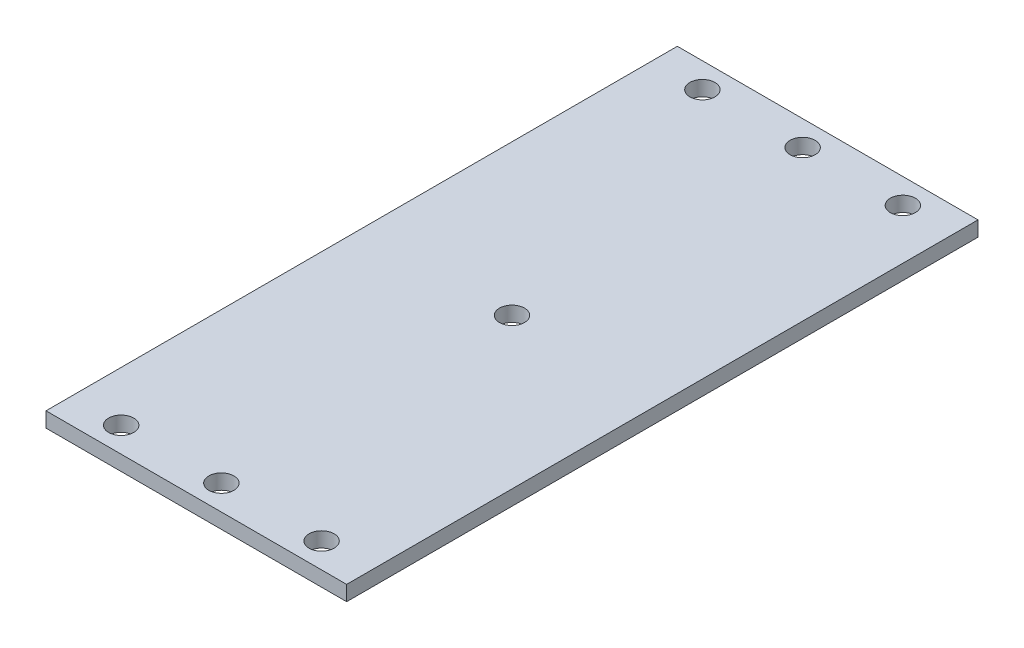
ISO-10303-21;
HEADER;
FILE_DESCRIPTION(('STEP AP214'),'2;1');
FILE_NAME('part.step','',(''),(''),'','','');
FILE_SCHEMA(('AUTOMOTIVE_DESIGN { 1 0 10303 214 1 1 1 1 }'));
ENDSEC;
DATA;
#1=APPLICATION_CONTEXT('core data for automotive mechanical design processes');
#2=APPLICATION_PROTOCOL_DEFINITION('international standard','automotive_design',2000,#1);
#3=PRODUCT_CONTEXT('',#1,'mechanical');
#4=PRODUCT('Part','Part','',(#3));
#5=PRODUCT_RELATED_PRODUCT_CATEGORY('part','',(#4));
#6=PRODUCT_DEFINITION_FORMATION('','',#4);
#7=PRODUCT_DEFINITION_CONTEXT('part definition',#1,'design');
#8=PRODUCT_DEFINITION('design','',#6,#7);
#9=PRODUCT_DEFINITION_SHAPE('','',#8);
#10=(LENGTH_UNIT() NAMED_UNIT(*) SI_UNIT(.MILLI.,.METRE.));
#11=(NAMED_UNIT(*) PLANE_ANGLE_UNIT() SI_UNIT($,.RADIAN.));
#12=(NAMED_UNIT(*) SI_UNIT($,.STERADIAN.) SOLID_ANGLE_UNIT());
#13=UNCERTAINTY_MEASURE_WITH_UNIT(LENGTH_MEASURE(1.E-05),#10,'distance_accuracy_value','');
#14=(GEOMETRIC_REPRESENTATION_CONTEXT(3) GLOBAL_UNCERTAINTY_ASSIGNED_CONTEXT((#13)) GLOBAL_UNIT_ASSIGNED_CONTEXT((#10,
#11,#12)) REPRESENTATION_CONTEXT('',''));
#15=CARTESIAN_POINT('',(0.,0.,0.));
#16=DIRECTION('',(0.,0.,1.));
#17=DIRECTION('',(1.,0.,0.));
#18=AXIS2_PLACEMENT_3D('',#15,#16,#17);
#19=CARTESIAN_POINT('',(30.,3.,-63.));
#20=DIRECTION('',(-1.,0.,0.));
#21=DIRECTION('',(0.,0.,1.));
#22=AXIS2_PLACEMENT_3D('',#19,#20,#21);
#23=PLANE('',#22);
#24=DIRECTION('',(0.,0.,-1.));
#25=VECTOR('',#24,1.);
#26=CARTESIAN_POINT('',(30.,0.,-63.));
#27=LINE('',#26,#25);
#28=CARTESIAN_POINT('',(30.,0.,63.));
#29=VERTEX_POINT('',#28);
#30=CARTESIAN_POINT('',(30.,0.,-63.));
#31=VERTEX_POINT('',#30);
#32=EDGE_CURVE('E110',#29,#31,#27,.T.);
#33=ORIENTED_EDGE('',*,*,#32,.T.);
#34=DIRECTION('',(0.,-1.,0.));
#35=VECTOR('',#34,1.);
#36=CARTESIAN_POINT('',(30.,3.,-63.));
#37=LINE('',#36,#35);
#38=CARTESIAN_POINT('',(30.,3.,-63.));
#39=VERTEX_POINT('',#38);
#40=EDGE_CURVE('E11',#39,#31,#37,.T.);
#41=ORIENTED_EDGE('',*,*,#40,.F.);
#42=DIRECTION('',(0.,0.,-1.));
#43=VECTOR('',#42,1.);
#44=CARTESIAN_POINT('',(30.,3.,-63.));
#45=LINE('',#44,#43);
#46=CARTESIAN_POINT('',(30.,3.,63.));
#47=VERTEX_POINT('',#46);
#48=EDGE_CURVE('E93',#47,#39,#45,.T.);
#49=ORIENTED_EDGE('',*,*,#48,.F.);
#50=DIRECTION('',(0.,-1.,0.));
#51=VECTOR('',#50,1.);
#52=CARTESIAN_POINT('',(30.,3.,63.));
#53=LINE('',#52,#51);
#54=EDGE_CURVE('E106',#47,#29,#53,.T.);
#55=ORIENTED_EDGE('',*,*,#54,.T.);
#56=EDGE_LOOP('',(#33,#41,#49,#55));
#57=FACE_BOUND('',#56,.T.);
#58=ADVANCED_FACE('F39',(#57),#23,.F.);
#59=CARTESIAN_POINT('',(-30.,3.,-63.));
#60=DIRECTION('',(0.,0.,1.));
#61=DIRECTION('',(1.,0.,0.));
#62=AXIS2_PLACEMENT_3D('',#59,#60,#61);
#63=PLANE('',#62);
#64=DIRECTION('',(-1.,0.,0.));
#65=VECTOR('',#64,1.);
#66=CARTESIAN_POINT('',(-30.,0.,-63.));
#67=LINE('',#66,#65);
#68=CARTESIAN_POINT('',(-30.,0.,-63.));
#69=VERTEX_POINT('',#68);
#70=EDGE_CURVE('E98',#31,#69,#67,.T.);
#71=ORIENTED_EDGE('',*,*,#70,.T.);
#72=DIRECTION('',(0.,-1.,0.));
#73=VECTOR('',#72,1.);
#74=CARTESIAN_POINT('',(-30.,3.,-63.));
#75=LINE('',#74,#73);
#76=CARTESIAN_POINT('',(-30.,3.,-63.));
#77=VERTEX_POINT('',#76);
#78=EDGE_CURVE('E49',#77,#69,#75,.T.);
#79=ORIENTED_EDGE('',*,*,#78,.F.);
#80=DIRECTION('',(-1.,0.,0.));
#81=VECTOR('',#80,1.);
#82=CARTESIAN_POINT('',(-30.,3.,-63.));
#83=LINE('',#82,#81);
#84=EDGE_CURVE('E88',#39,#77,#83,.T.);
#85=ORIENTED_EDGE('',*,*,#84,.F.);
#86=ORIENTED_EDGE('',*,*,#40,.T.);
#87=EDGE_LOOP('',(#71,#79,#85,#86));
#88=FACE_BOUND('',#87,.T.);
#89=ADVANCED_FACE('F97',(#88),#63,.F.);
#90=CARTESIAN_POINT('',(-30.,3.,-63.));
#91=DIRECTION('',(1.,0.,0.));
#92=DIRECTION('',(0.,0.,-1.));
#93=AXIS2_PLACEMENT_3D('',#90,#91,#92);
#94=PLANE('',#93);
#95=DIRECTION('',(0.,0.,1.));
#96=VECTOR('',#95,1.);
#97=CARTESIAN_POINT('',(-30.,0.,-63.));
#98=LINE('',#97,#96);
#99=CARTESIAN_POINT('',(-30.,0.,63.));
#100=VERTEX_POINT('',#99);
#101=EDGE_CURVE('E75',#69,#100,#98,.T.);
#102=ORIENTED_EDGE('',*,*,#101,.T.);
#103=DIRECTION('',(0.,-1.,0.));
#104=VECTOR('',#103,1.);
#105=CARTESIAN_POINT('',(-30.,3.,63.));
#106=LINE('',#105,#104);
#107=CARTESIAN_POINT('',(-30.,3.,63.));
#108=VERTEX_POINT('',#107);
#109=EDGE_CURVE('E100',#108,#100,#106,.T.);
#110=ORIENTED_EDGE('',*,*,#109,.F.);
#111=DIRECTION('',(0.,0.,1.));
#112=VECTOR('',#111,1.);
#113=CARTESIAN_POINT('',(-30.,3.,-63.));
#114=LINE('',#113,#112);
#115=EDGE_CURVE('E91',#77,#108,#114,.T.);
#116=ORIENTED_EDGE('',*,*,#115,.F.);
#117=ORIENTED_EDGE('',*,*,#78,.T.);
#118=EDGE_LOOP('',(#102,#110,#116,#117));
#119=FACE_BOUND('',#118,.T.);
#120=ADVANCED_FACE('F102',(#119),#94,.F.);
#121=CARTESIAN_POINT('',(-30.,3.,63.));
#122=DIRECTION('',(0.,0.,-1.));
#123=DIRECTION('',(-1.,0.,0.));
#124=AXIS2_PLACEMENT_3D('',#121,#122,#123);
#125=PLANE('',#124);
#126=DIRECTION('',(1.,0.,0.));
#127=VECTOR('',#126,1.);
#128=CARTESIAN_POINT('',(-30.,0.,63.));
#129=LINE('',#128,#127);
#130=EDGE_CURVE('E81',#100,#29,#129,.T.);
#131=ORIENTED_EDGE('',*,*,#130,.T.);
#132=ORIENTED_EDGE('',*,*,#54,.F.);
#133=DIRECTION('',(1.,0.,0.));
#134=VECTOR('',#133,1.);
#135=CARTESIAN_POINT('',(-30.,3.,63.));
#136=LINE('',#135,#134);
#137=EDGE_CURVE('E58',#108,#47,#136,.T.);
#138=ORIENTED_EDGE('',*,*,#137,.F.);
#139=ORIENTED_EDGE('',*,*,#109,.T.);
#140=EDGE_LOOP('',(#131,#132,#138,#139));
#141=FACE_BOUND('',#140,.T.);
#142=ADVANCED_FACE('F185',(#141),#125,.F.);
#143=CARTESIAN_POINT('',(0.,3.,0.));
#144=DIRECTION('',(0.,1.,0.));
#145=DIRECTION('',(0.,0.,1.));
#146=AXIS2_PLACEMENT_3D('',#143,#144,#145);
#147=PLANE('',#146);
#148=CARTESIAN_POINT('',(20.,3.,58.));
#149=DIRECTION('',(0.,1.,0.));
#150=DIRECTION('',(0.,0.,1.));
#151=AXIS2_PLACEMENT_3D('',#148,#149,#150);
#152=CIRCLE('',#151,2.5);
#153=CARTESIAN_POINT('',(20.,3.,60.5));
#154=VERTEX_POINT('',#153);
#155=EDGE_CURVE('E291',#154,#154,#152,.T.);
#156=ORIENTED_EDGE('',*,*,#155,.F.);
#157=EDGE_LOOP('',(#156));
#158=FACE_BOUND('',#157,.T.);
#159=CARTESIAN_POINT('',(-20.,3.,58.));
#160=DIRECTION('',(0.,1.,0.));
#161=DIRECTION('',(0.,0.,1.));
#162=AXIS2_PLACEMENT_3D('',#159,#160,#161);
#163=CIRCLE('',#162,2.5);
#164=CARTESIAN_POINT('',(-20.,3.,60.5));
#165=VERTEX_POINT('',#164);
#166=EDGE_CURVE('E285',#165,#165,#163,.T.);
#167=ORIENTED_EDGE('',*,*,#166,.F.);
#168=EDGE_LOOP('',(#167));
#169=FACE_BOUND('',#168,.T.);
#170=CARTESIAN_POINT('',(20.,3.,-58.));
#171=DIRECTION('',(0.,1.,0.));
#172=DIRECTION('',(0.,0.,-1.));
#173=AXIS2_PLACEMENT_3D('',#170,#171,#172);
#174=CIRCLE('',#173,2.5);
#175=CARTESIAN_POINT('',(20.,3.,-60.5));
#176=VERTEX_POINT('',#175);
#177=EDGE_CURVE('E268',#176,#176,#174,.T.);
#178=ORIENTED_EDGE('',*,*,#177,.F.);
#179=EDGE_LOOP('',(#178));
#180=FACE_BOUND('',#179,.T.);
#181=CARTESIAN_POINT('',(0.,3.,-58.));
#182=DIRECTION('',(0.,1.,0.));
#183=DIRECTION('',(0.,0.,-1.));
#184=AXIS2_PLACEMENT_3D('',#181,#182,#183);
#185=CIRCLE('',#184,2.5);
#186=CARTESIAN_POINT('',(0.,3.,-60.5));
#187=VERTEX_POINT('',#186);
#188=EDGE_CURVE('E286',#187,#187,#185,.T.);
#189=ORIENTED_EDGE('',*,*,#188,.F.);
#190=EDGE_LOOP('',(#189));
#191=FACE_BOUND('',#190,.T.);
#192=CARTESIAN_POINT('',(-20.,3.,-58.));
#193=DIRECTION('',(0.,1.,0.));
#194=DIRECTION('',(0.,0.,-1.));
#195=AXIS2_PLACEMENT_3D('',#192,#193,#194);
#196=CIRCLE('',#195,2.5);
#197=CARTESIAN_POINT('',(-20.,3.,-60.5));
#198=VERTEX_POINT('',#197);
#199=EDGE_CURVE('E294',#198,#198,#196,.T.);
#200=ORIENTED_EDGE('',*,*,#199,.F.);
#201=EDGE_LOOP('',(#200));
#202=FACE_BOUND('',#201,.T.);
#203=CARTESIAN_POINT('',(0.,3.,0.));
#204=DIRECTION('',(0.,1.,0.));
#205=DIRECTION('',(0.,0.,1.));
#206=AXIS2_PLACEMENT_3D('',#203,#204,#205);
#207=CIRCLE('',#206,2.5);
#208=CARTESIAN_POINT('',(0.,3.,2.49999999999999));
#209=VERTEX_POINT('',#208);
#210=EDGE_CURVE('E305',#209,#209,#207,.T.);
#211=ORIENTED_EDGE('',*,*,#210,.F.);
#212=EDGE_LOOP('',(#211));
#213=FACE_BOUND('',#212,.T.);
#214=CARTESIAN_POINT('',(0.,3.,58.));
#215=DIRECTION('',(0.,1.,0.));
#216=DIRECTION('',(0.,0.,1.));
#217=AXIS2_PLACEMENT_3D('',#214,#215,#216);
#218=CIRCLE('',#217,2.5);
#219=CARTESIAN_POINT('',(0.,3.,60.5));
#220=VERTEX_POINT('',#219);
#221=EDGE_CURVE('E129',#220,#220,#218,.T.);
#222=ORIENTED_EDGE('',*,*,#221,.F.);
#223=EDGE_LOOP('',(#222));
#224=FACE_BOUND('',#223,.T.);
#225=ORIENTED_EDGE('',*,*,#48,.T.);
#226=ORIENTED_EDGE('',*,*,#84,.T.);
#227=ORIENTED_EDGE('',*,*,#115,.T.);
#228=ORIENTED_EDGE('',*,*,#137,.T.);
#229=EDGE_LOOP('',(#225,#226,#227,#228));
#230=FACE_BOUND('',#229,.T.);
#231=ADVANCED_FACE('F89',(#158,#169,#180,#191,#202,#213,#224,#230),#147,.T.);
#232=CARTESIAN_POINT('',(0.,0.,0.));
#233=DIRECTION('',(0.,1.,0.));
#234=DIRECTION('',(0.,0.,1.));
#235=AXIS2_PLACEMENT_3D('',#232,#233,#234);
#236=PLANE('',#235);
#237=CARTESIAN_POINT('',(20.,0.,58.));
#238=DIRECTION('',(0.,1.,0.));
#239=DIRECTION('',(0.,0.,1.));
#240=AXIS2_PLACEMENT_3D('',#237,#238,#239);
#241=CIRCLE('',#240,2.5);
#242=CARTESIAN_POINT('',(20.,0.,60.5));
#243=VERTEX_POINT('',#242);
#244=EDGE_CURVE('E42',#243,#243,#241,.T.);
#245=ORIENTED_EDGE('',*,*,#244,.T.);
#246=EDGE_LOOP('',(#245));
#247=FACE_BOUND('',#246,.T.);
#248=CARTESIAN_POINT('',(-20.,0.,58.));
#249=DIRECTION('',(0.,1.,0.));
#250=DIRECTION('',(0.,0.,1.));
#251=AXIS2_PLACEMENT_3D('',#248,#249,#250);
#252=CIRCLE('',#251,2.5);
#253=CARTESIAN_POINT('',(-20.,0.,60.5));
#254=VERTEX_POINT('',#253);
#255=EDGE_CURVE('E144',#254,#254,#252,.T.);
#256=ORIENTED_EDGE('',*,*,#255,.T.);
#257=EDGE_LOOP('',(#256));
#258=FACE_BOUND('',#257,.T.);
#259=CARTESIAN_POINT('',(20.,0.,-58.));
#260=DIRECTION('',(0.,1.,0.));
#261=DIRECTION('',(0.,0.,1.));
#262=AXIS2_PLACEMENT_3D('',#259,#260,#261);
#263=CIRCLE('',#262,2.5);
#264=CARTESIAN_POINT('',(20.,0.,-55.5));
#265=VERTEX_POINT('',#264);
#266=EDGE_CURVE('E141',#265,#265,#263,.T.);
#267=ORIENTED_EDGE('',*,*,#266,.T.);
#268=EDGE_LOOP('',(#267));
#269=FACE_BOUND('',#268,.T.);
#270=CARTESIAN_POINT('',(0.,0.,-58.));
#271=DIRECTION('',(0.,1.,0.));
#272=DIRECTION('',(0.,0.,1.));
#273=AXIS2_PLACEMENT_3D('',#270,#271,#272);
#274=CIRCLE('',#273,2.5);
#275=CARTESIAN_POINT('',(0.,0.,-55.5));
#276=VERTEX_POINT('',#275);
#277=EDGE_CURVE('E137',#276,#276,#274,.T.);
#278=ORIENTED_EDGE('',*,*,#277,.T.);
#279=EDGE_LOOP('',(#278));
#280=FACE_BOUND('',#279,.T.);
#281=CARTESIAN_POINT('',(-20.,0.,-58.));
#282=DIRECTION('',(0.,1.,0.));
#283=DIRECTION('',(0.,0.,1.));
#284=AXIS2_PLACEMENT_3D('',#281,#282,#283);
#285=CIRCLE('',#284,2.5);
#286=CARTESIAN_POINT('',(-20.,0.,-55.5));
#287=VERTEX_POINT('',#286);
#288=EDGE_CURVE('E133',#287,#287,#285,.T.);
#289=ORIENTED_EDGE('',*,*,#288,.T.);
#290=EDGE_LOOP('',(#289));
#291=FACE_BOUND('',#290,.T.);
#292=CARTESIAN_POINT('',(0.,0.,0.));
#293=DIRECTION('',(0.,1.,0.));
#294=DIRECTION('',(0.,0.,1.));
#295=AXIS2_PLACEMENT_3D('',#292,#293,#294);
#296=CIRCLE('',#295,2.5);
#297=CARTESIAN_POINT('',(0.,0.,2.49999999999999));
#298=VERTEX_POINT('',#297);
#299=EDGE_CURVE('E128',#298,#298,#296,.T.);
#300=ORIENTED_EDGE('',*,*,#299,.T.);
#301=EDGE_LOOP('',(#300));
#302=FACE_BOUND('',#301,.T.);
#303=CARTESIAN_POINT('',(0.,0.,58.));
#304=DIRECTION('',(0.,1.,0.));
#305=DIRECTION('',(0.,0.,1.));
#306=AXIS2_PLACEMENT_3D('',#303,#304,#305);
#307=CIRCLE('',#306,2.5);
#308=CARTESIAN_POINT('',(0.,0.,60.5));
#309=VERTEX_POINT('',#308);
#310=EDGE_CURVE('E124',#309,#309,#307,.T.);
#311=ORIENTED_EDGE('',*,*,#310,.T.);
#312=EDGE_LOOP('',(#311));
#313=FACE_BOUND('',#312,.T.);
#314=ORIENTED_EDGE('',*,*,#32,.F.);
#315=ORIENTED_EDGE('',*,*,#130,.F.);
#316=ORIENTED_EDGE('',*,*,#101,.F.);
#317=ORIENTED_EDGE('',*,*,#70,.F.);
#318=EDGE_LOOP('',(#314,#315,#316,#317));
#319=FACE_BOUND('',#318,.T.);
#320=ADVANCED_FACE('F153',(#247,#258,#269,#280,#291,#302,#313,#319),#236,.F.);
#321=CARTESIAN_POINT('',(0.,-2.,58.));
#322=DIRECTION('',(0.,1.,0.));
#323=DIRECTION('',(0.,0.,1.));
#324=AXIS2_PLACEMENT_3D('',#321,#322,#323);
#325=CYLINDRICAL_SURFACE('',#324,2.5);
#326=ORIENTED_EDGE('',*,*,#221,.T.);
#327=EDGE_LOOP('',(#326));
#328=FACE_BOUND('',#327,.T.);
#329=ORIENTED_EDGE('',*,*,#310,.F.);
#330=EDGE_LOOP('',(#329));
#331=FACE_BOUND('',#330,.T.);
#332=ADVANCED_FACE('F176',(#328,#331),#325,.F.);
#333=CARTESIAN_POINT('',(0.,-2.,0.));
#334=DIRECTION('',(0.,1.,0.));
#335=DIRECTION('',(0.,0.,1.));
#336=AXIS2_PLACEMENT_3D('',#333,#334,#335);
#337=CYLINDRICAL_SURFACE('',#336,2.5);
#338=ORIENTED_EDGE('',*,*,#210,.T.);
#339=EDGE_LOOP('',(#338));
#340=FACE_BOUND('',#339,.T.);
#341=ORIENTED_EDGE('',*,*,#299,.F.);
#342=EDGE_LOOP('',(#341));
#343=FACE_BOUND('',#342,.T.);
#344=ADVANCED_FACE('F182',(#340,#343),#337,.F.);
#345=CARTESIAN_POINT('',(-20.,-2.,-58.));
#346=DIRECTION('',(0.,1.,0.));
#347=DIRECTION('',(0.,0.,1.));
#348=AXIS2_PLACEMENT_3D('',#345,#346,#347);
#349=CYLINDRICAL_SURFACE('',#348,2.5);
#350=ORIENTED_EDGE('',*,*,#199,.T.);
#351=EDGE_LOOP('',(#350));
#352=FACE_BOUND('',#351,.T.);
#353=ORIENTED_EDGE('',*,*,#288,.F.);
#354=EDGE_LOOP('',(#353));
#355=FACE_BOUND('',#354,.T.);
#356=ADVANCED_FACE('F223',(#352,#355),#349,.F.);
#357=CARTESIAN_POINT('',(0.,-2.,-58.));
#358=DIRECTION('',(0.,1.,0.));
#359=DIRECTION('',(0.,0.,1.));
#360=AXIS2_PLACEMENT_3D('',#357,#358,#359);
#361=CYLINDRICAL_SURFACE('',#360,2.5);
#362=ORIENTED_EDGE('',*,*,#188,.T.);
#363=EDGE_LOOP('',(#362));
#364=FACE_BOUND('',#363,.T.);
#365=ORIENTED_EDGE('',*,*,#277,.F.);
#366=EDGE_LOOP('',(#365));
#367=FACE_BOUND('',#366,.T.);
#368=ADVANCED_FACE('F232',(#364,#367),#361,.F.);
#369=CARTESIAN_POINT('',(20.,-2.,-58.));
#370=DIRECTION('',(0.,1.,0.));
#371=DIRECTION('',(0.,0.,1.));
#372=AXIS2_PLACEMENT_3D('',#369,#370,#371);
#373=CYLINDRICAL_SURFACE('',#372,2.5);
#374=ORIENTED_EDGE('',*,*,#177,.T.);
#375=EDGE_LOOP('',(#374));
#376=FACE_BOUND('',#375,.T.);
#377=ORIENTED_EDGE('',*,*,#266,.F.);
#378=EDGE_LOOP('',(#377));
#379=FACE_BOUND('',#378,.T.);
#380=ADVANCED_FACE('F163',(#376,#379),#373,.F.);
#381=CARTESIAN_POINT('',(-20.,-2.,58.));
#382=DIRECTION('',(0.,1.,0.));
#383=DIRECTION('',(0.,0.,1.));
#384=AXIS2_PLACEMENT_3D('',#381,#382,#383);
#385=CYLINDRICAL_SURFACE('',#384,2.5);
#386=ORIENTED_EDGE('',*,*,#166,.T.);
#387=EDGE_LOOP('',(#386));
#388=FACE_BOUND('',#387,.T.);
#389=ORIENTED_EDGE('',*,*,#255,.F.);
#390=EDGE_LOOP('',(#389));
#391=FACE_BOUND('',#390,.T.);
#392=ADVANCED_FACE('F157',(#388,#391),#385,.F.);
#393=CARTESIAN_POINT('',(20.,-2.,58.));
#394=DIRECTION('',(0.,1.,0.));
#395=DIRECTION('',(0.,0.,1.));
#396=AXIS2_PLACEMENT_3D('',#393,#394,#395);
#397=CYLINDRICAL_SURFACE('',#396,2.5);
#398=ORIENTED_EDGE('',*,*,#155,.T.);
#399=EDGE_LOOP('',(#398));
#400=FACE_BOUND('',#399,.T.);
#401=ORIENTED_EDGE('',*,*,#244,.F.);
#402=EDGE_LOOP('',(#401));
#403=FACE_BOUND('',#402,.T.);
#404=ADVANCED_FACE('F155',(#400,#403),#397,.F.);
#405=CLOSED_SHELL('',(#58,#89,#120,#142,#231,#320,#332,#344,#356,#368,#380,#392,#404));
#406=MANIFOLD_SOLID_BREP('B2',#405);
#407=ADVANCED_BREP_SHAPE_REPRESENTATION('',(#18,#406),#14);
#408=SHAPE_DEFINITION_REPRESENTATION(#9,#407);
ENDSEC;
END-ISO-10303-21;
